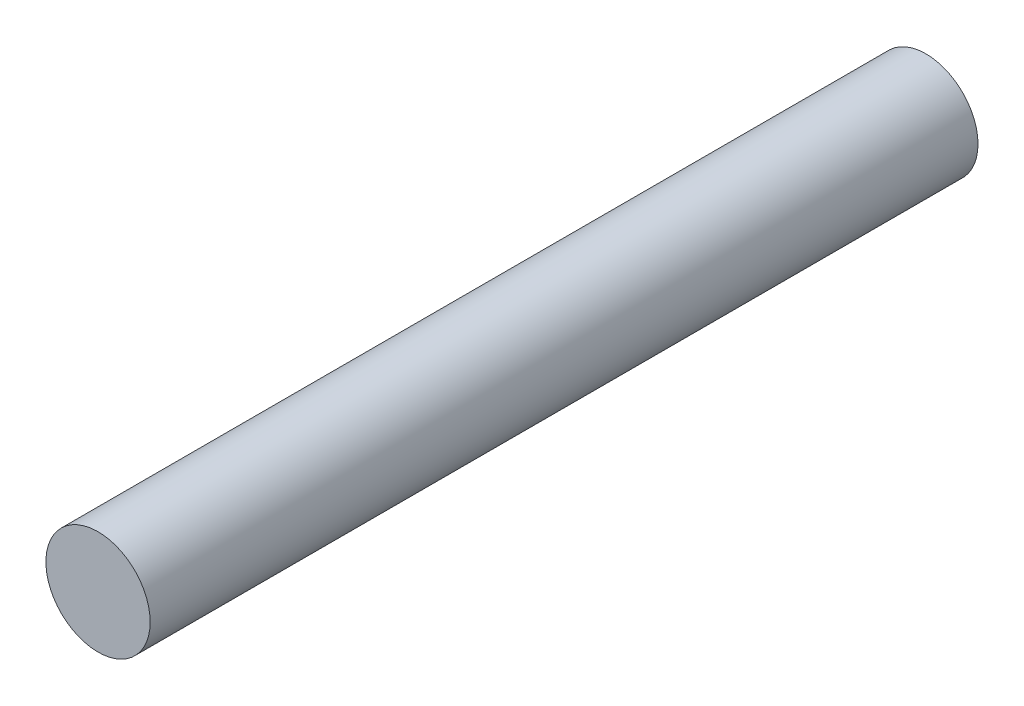
ISO-10303-21;
HEADER;
FILE_DESCRIPTION(('STEP AP214'),'2;1');
FILE_NAME('part.step','',(''),(''),'','','');
FILE_SCHEMA(('AUTOMOTIVE_DESIGN { 1 0 10303 214 1 1 1 1 }'));
ENDSEC;
DATA;
#1=APPLICATION_CONTEXT('core data for automotive mechanical design processes');
#2=APPLICATION_PROTOCOL_DEFINITION('international standard','automotive_design',2000,#1);
#3=PRODUCT_CONTEXT('',#1,'mechanical');
#4=PRODUCT('Part','Part','',(#3));
#5=PRODUCT_RELATED_PRODUCT_CATEGORY('part','',(#4));
#6=PRODUCT_DEFINITION_FORMATION('','',#4);
#7=PRODUCT_DEFINITION_CONTEXT('part definition',#1,'design');
#8=PRODUCT_DEFINITION('design','',#6,#7);
#9=PRODUCT_DEFINITION_SHAPE('','',#8);
#10=(LENGTH_UNIT() NAMED_UNIT(*) SI_UNIT(.MILLI.,.METRE.));
#11=(NAMED_UNIT(*) PLANE_ANGLE_UNIT() SI_UNIT($,.RADIAN.));
#12=(NAMED_UNIT(*) SI_UNIT($,.STERADIAN.) SOLID_ANGLE_UNIT());
#13=UNCERTAINTY_MEASURE_WITH_UNIT(LENGTH_MEASURE(1.E-05),#10,'distance_accuracy_value','');
#14=(GEOMETRIC_REPRESENTATION_CONTEXT(3) GLOBAL_UNCERTAINTY_ASSIGNED_CONTEXT((#13)) GLOBAL_UNIT_ASSIGNED_CONTEXT((#10,
#11,#12)) REPRESENTATION_CONTEXT('',''));
#15=CARTESIAN_POINT('',(0.,0.,0.));
#16=DIRECTION('',(0.,0.,1.));
#17=DIRECTION('',(1.,0.,0.));
#18=AXIS2_PLACEMENT_3D('',#15,#16,#17);
#19=CARTESIAN_POINT('',(0.,0.,7.94));
#20=DIRECTION('',(0.,0.,-1.));
#21=DIRECTION('',(-1.,0.,0.));
#22=AXIS2_PLACEMENT_3D('',#19,#20,#21);
#23=CYLINDRICAL_SURFACE('',#22,1.);
#24=CARTESIAN_POINT('',(0.,0.,7.94));
#25=DIRECTION('',(0.,0.,1.));
#26=DIRECTION('',(1.,0.,0.));
#27=AXIS2_PLACEMENT_3D('',#24,#25,#26);
#28=CIRCLE('',#27,1.);
#29=CARTESIAN_POINT('',(1.,0.,7.94));
#30=VERTEX_POINT('',#29);
#31=EDGE_CURVE('E10',#30,#30,#28,.T.);
#32=ORIENTED_EDGE('',*,*,#31,.F.);
#33=EDGE_LOOP('',(#32));
#34=FACE_BOUND('',#33,.T.);
#35=CARTESIAN_POINT('',(0.,0.,-7.94));
#36=DIRECTION('',(0.,0.,1.));
#37=DIRECTION('',(1.,0.,0.));
#38=AXIS2_PLACEMENT_3D('',#35,#36,#37);
#39=CIRCLE('',#38,1.);
#40=CARTESIAN_POINT('',(1.,0.,-7.94));
#41=VERTEX_POINT('',#40);
#42=EDGE_CURVE('E34',#41,#41,#39,.T.);
#43=ORIENTED_EDGE('',*,*,#42,.T.);
#44=EDGE_LOOP('',(#43));
#45=FACE_BOUND('',#44,.T.);
#46=ADVANCED_FACE('F31',(#34,#45),#23,.T.);
#47=CARTESIAN_POINT('',(0.,0.,7.94));
#48=DIRECTION('',(0.,0.,1.));
#49=DIRECTION('',(1.,0.,0.));
#50=AXIS2_PLACEMENT_3D('',#47,#48,#49);
#51=PLANE('',#50);
#52=ORIENTED_EDGE('',*,*,#31,.T.);
#53=EDGE_LOOP('',(#52));
#54=FACE_BOUND('',#53,.T.);
#55=ADVANCED_FACE('F46',(#54),#51,.T.);
#56=CARTESIAN_POINT('',(0.,0.,-7.94));
#57=DIRECTION('',(0.,0.,1.));
#58=DIRECTION('',(1.,0.,0.));
#59=AXIS2_PLACEMENT_3D('',#56,#57,#58);
#60=PLANE('',#59);
#61=ORIENTED_EDGE('',*,*,#42,.F.);
#62=EDGE_LOOP('',(#61));
#63=FACE_BOUND('',#62,.T.);
#64=ADVANCED_FACE('F44',(#63),#60,.F.);
#65=CLOSED_SHELL('',(#46,#55,#64));
#66=MANIFOLD_SOLID_BREP('B2',#65);
#67=ADVANCED_BREP_SHAPE_REPRESENTATION('',(#18,#66),#14);
#68=SHAPE_DEFINITION_REPRESENTATION(#9,#67);
ENDSEC;
END-ISO-10303-21;
